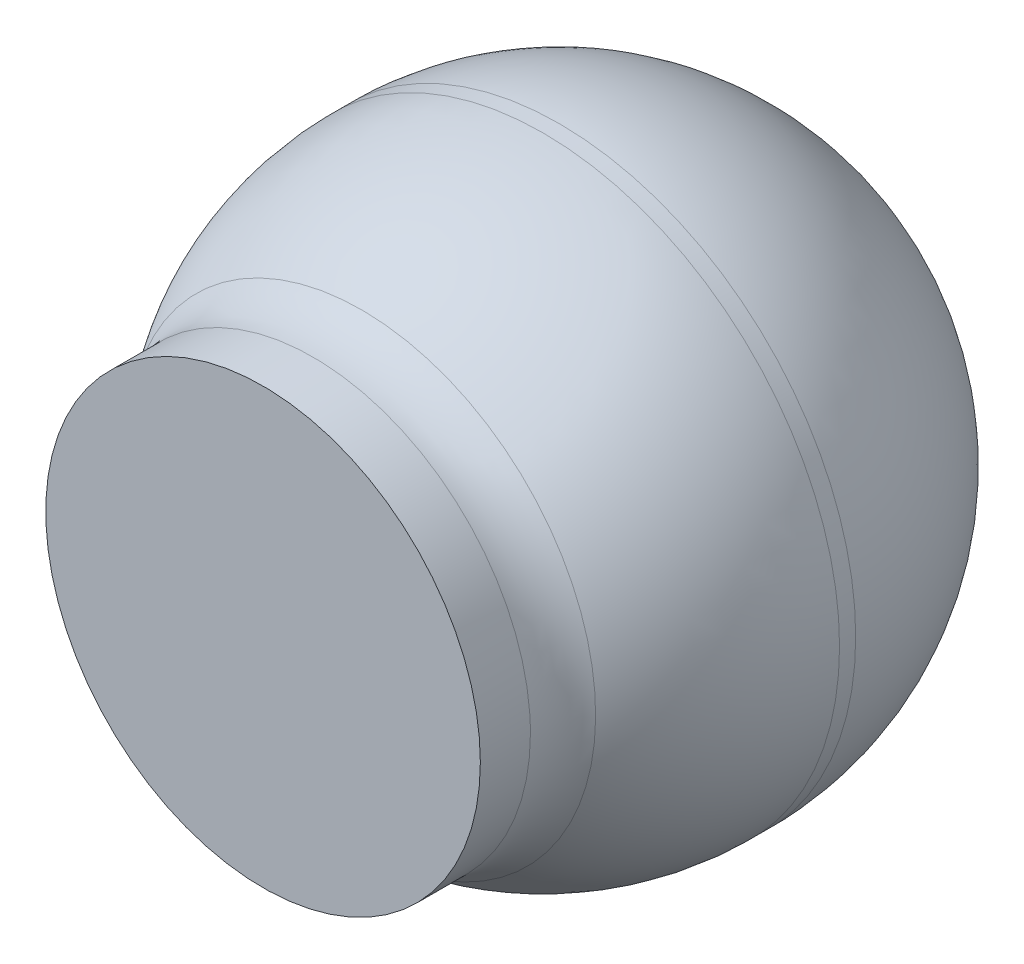
ISO-10303-21;
HEADER;
FILE_DESCRIPTION(('STEP AP214'),'2;1');
FILE_NAME('part.step','',(''),(''),'','','');
FILE_SCHEMA(('AUTOMOTIVE_DESIGN { 1 0 10303 214 1 1 1 1 }'));
ENDSEC;
DATA;
#1=APPLICATION_CONTEXT('core data for automotive mechanical design processes');
#2=APPLICATION_PROTOCOL_DEFINITION('international standard','automotive_design',2000,#1);
#3=PRODUCT_CONTEXT('',#1,'mechanical');
#4=PRODUCT('Part','Part','',(#3));
#5=PRODUCT_RELATED_PRODUCT_CATEGORY('part','',(#4));
#6=PRODUCT_DEFINITION_FORMATION('','',#4);
#7=PRODUCT_DEFINITION_CONTEXT('part definition',#1,'design');
#8=PRODUCT_DEFINITION('design','',#6,#7);
#9=PRODUCT_DEFINITION_SHAPE('','',#8);
#10=(LENGTH_UNIT() NAMED_UNIT(*) SI_UNIT(.MILLI.,.METRE.));
#11=(NAMED_UNIT(*) PLANE_ANGLE_UNIT() SI_UNIT($,.RADIAN.));
#12=(NAMED_UNIT(*) SI_UNIT($,.STERADIAN.) SOLID_ANGLE_UNIT());
#13=UNCERTAINTY_MEASURE_WITH_UNIT(LENGTH_MEASURE(1.E-05),#10,'distance_accuracy_value','');
#14=(GEOMETRIC_REPRESENTATION_CONTEXT(3) GLOBAL_UNCERTAINTY_ASSIGNED_CONTEXT((#13)) GLOBAL_UNIT_ASSIGNED_CONTEXT((#10,
#11,#12)) REPRESENTATION_CONTEXT('',''));
#15=CARTESIAN_POINT('',(0.,0.,0.));
#16=DIRECTION('',(0.,0.,1.));
#17=DIRECTION('',(1.,0.,0.));
#18=AXIS2_PLACEMENT_3D('',#15,#16,#17);
#19=CARTESIAN_POINT('',(-6.912919922269,-9.131349291452,10.006534503384));
#20=DIRECTION('',(0.,0.,-1.));
#21=DIRECTION('',(-1.,0.,0.));
#22=AXIS2_PLACEMENT_3D('',#19,#20,#21);
#23=PLANE('',#22);
#24=CARTESIAN_POINT('',(-6.912919922269,-9.131349291452,10.006534503384));
#25=DIRECTION('',(0.,0.,1.));
#26=DIRECTION('',(1.,0.,0.));
#27=AXIS2_PLACEMENT_3D('',#24,#25,#26);
#28=CIRCLE('',#27,0.275);
#29=CARTESIAN_POINT('',(-6.637919922269,-9.131349291452,10.006534503384));
#30=VERTEX_POINT('',#29);
#31=EDGE_CURVE('E20',#30,#30,#28,.F.);
#32=ORIENTED_EDGE('',*,*,#31,.F.);
#33=EDGE_LOOP('',(#32));
#34=FACE_BOUND('',#33,.T.);
#35=ADVANCED_FACE('F17',(#34),#23,.F.);
#36=CARTESIAN_POINT('',(-6.912919922269,-9.131349291452,9.906534503384));
#37=DIRECTION('',(0.,0.,1.));
#38=DIRECTION('',(1.,0.,0.));
#39=AXIS2_PLACEMENT_3D('',#36,#37,#38);
#40=CYLINDRICAL_SURFACE('',#39,0.275);
#41=CARTESIAN_POINT('',(-6.912919922269,-9.131349291452,9.943180457728));
#42=DIRECTION('',(0.,0.,-1.));
#43=DIRECTION('',(0.996700902337582,0.081162252799247,0.));
#44=AXIS2_PLACEMENT_3D('',#41,#42,#43);
#45=CIRCLE('',#44,0.275);
#46=CARTESIAN_POINT('',(-6.63882717412617,-9.10902967193221,9.943180457728));
#47=VERTEX_POINT('',#46);
#48=EDGE_CURVE('E65',#47,#47,#45,.F.);
#49=ORIENTED_EDGE('',*,*,#48,.T.);
#50=EDGE_LOOP('',(#49));
#51=FACE_BOUND('',#50,.T.);
#52=ORIENTED_EDGE('',*,*,#31,.T.);
#53=EDGE_LOOP('',(#52));
#54=FACE_BOUND('',#53,.T.);
#55=ADVANCED_FACE('F62',(#51,#54),#40,.T.);
#56=CARTESIAN_POINT('',(-6.912919922269,-9.131349291452,9.943180457728));
#57=DIRECTION('',(0.,0.,-1.));
#58=DIRECTION('',(0.996700902337583,0.0811622527992448,0.));
#59=AXIS2_PLACEMENT_3D('',#56,#57,#58);
#60=TOROIDAL_SURFACE('',#59,0.375,0.1);
#61=ORIENTED_EDGE('',*,*,#48,.F.);
#62=EDGE_LOOP('',(#61));
#63=FACE_BOUND('',#62,.T.);
#64=CARTESIAN_POINT('',(-6.912919922269,-9.131349291452,9.881744931236));
#65=DIRECTION('',(0.,0.,-1.));
#66=DIRECTION('',(-0.996700902337598,-0.0811622527990622,0.));
#67=AXIS2_PLACEMENT_3D('',#64,#65,#66);
#68=CIRCLE('',#67,0.296097046412665);
#69=CARTESIAN_POINT('',(-7.208040115608,-9.155381194786,9.881744931236));
#70=VERTEX_POINT('',#69);
#71=EDGE_CURVE('E39',#70,#70,#68,.T.);
#72=ORIENTED_EDGE('',*,*,#71,.F.);
#73=EDGE_LOOP('',(#72));
#74=FACE_BOUND('',#73,.T.);
#75=ADVANCED_FACE('F57',(#63,#74),#60,.F.);
#76=CARTESIAN_POINT('',(-7.286682760645,-9.161785136252,9.651976062157));
#77=CARTESIAN_POINT('',(-7.286682760645,-9.161785136252,9.701461392103));
#78=CARTESIAN_POINT('',(-7.278526217348,-9.161120941579,9.750947004335));
#79=CARTESIAN_POINT('',(-7.262207085349,-9.159792059952,9.798626332798));
#80=CARTESIAN_POINT('',(-7.238341390838,-9.157848654938,9.842699544317));
#81=CARTESIAN_POINT('',(-7.208040115608,-9.155381194786,9.881744931236));
#82=(BOUNDED_CURVE() B_SPLINE_CURVE(5,(#76,#77,#78,#79,#80,#81),.UNSPECIFIED.,.F.,
.F.) B_SPLINE_CURVE_WITH_KNOTS((6,6),(0.,0.661568582165),
.UNSPECIFIED.) CURVE() GEOMETRIC_REPRESENTATION_ITEM() RATIONAL_B_SPLINE_CURVE((1.,1.,1.,1.,1.,1.)) REPRESENTATION_ITEM(''));
#83=CARTESIAN_POINT('',(-6.912919922269,-9.131349291452,9.651976062157));
#84=DIRECTION('',(0.,0.,-1.));
#85=AXIS1_PLACEMENT('',#83,#84);
#86=SURFACE_OF_REVOLUTION('',#82,#85);
#87=CARTESIAN_POINT('',(-6.912919922269,-9.131349291452,9.651976062157));
#88=DIRECTION('',(0.,0.,1.));
#89=DIRECTION('',(1.,0.,0.));
#90=AXIS2_PLACEMENT_3D('',#87,#88,#89);
#91=CIRCLE('',#90,0.375);
#92=CARTESIAN_POINT('',(-6.537919922269,-9.131349291452,9.651976062157));
#93=VERTEX_POINT('',#92);
#94=EDGE_CURVE('E36',#93,#93,#91,.F.);
#95=ORIENTED_EDGE('',*,*,#94,.F.);
#96=EDGE_LOOP('',(#95));
#97=FACE_BOUND('',#96,.T.);
#98=ORIENTED_EDGE('',*,*,#71,.T.);
#99=EDGE_LOOP('',(#98));
#100=FACE_BOUND('',#99,.T.);
#101=ADVANCED_FACE('F53',(#97,#100),#86,.F.);
#102=CARTESIAN_POINT('',(-6.912919922269,-9.131349291452,9.256534503384));
#103=DIRECTION('',(0.,0.,1.));
#104=DIRECTION('',(1.,0.,0.));
#105=AXIS2_PLACEMENT_3D('',#102,#103,#104);
#106=CYLINDRICAL_SURFACE('',#105,0.375);
#107=CARTESIAN_POINT('',(-6.912919922269,-9.131349291452,9.631534503384));
#108=DIRECTION('',(0.,0.,-1.));
#109=DIRECTION('',(0.0811622527992357,-0.996700902337583,0.));
#110=AXIS2_PLACEMENT_3D('',#107,#108,#109);
#111=CIRCLE('',#110,0.375);
#112=CARTESIAN_POINT('',(-6.88248407746929,-9.50511212982859,9.631534503384));
#113=VERTEX_POINT('',#112);
#114=CARTESIAN_POINT('',(-6.94335576706871,-8.75758645307541,9.631534503384));
#115=VERTEX_POINT('',#114);
#116=EDGE_CURVE('E11',#113,#115,#111,.T.);
#117=ORIENTED_EDGE('',*,*,#116,.F.);
#118=CARTESIAN_POINT('',(-6.912919922269,-9.131349291452,9.631534503384));
#119=DIRECTION('',(0.,0.,1.));
#120=DIRECTION('',(0.0811622527992365,-0.996700902337583,0.));
#121=AXIS2_PLACEMENT_3D('',#118,#119,#120);
#122=CIRCLE('',#121,0.375);
#123=EDGE_CURVE('E25',#115,#113,#122,.F.);
#124=ORIENTED_EDGE('',*,*,#123,.F.);
#125=EDGE_LOOP('',(#117,#124));
#126=FACE_BOUND('',#125,.T.);
#127=ORIENTED_EDGE('',*,*,#94,.T.);
#128=EDGE_LOOP('',(#127));
#129=FACE_BOUND('',#128,.T.);
#130=ADVANCED_FACE('F34',(#126,#129),#106,.T.);
#131=CARTESIAN_POINT('',(-6.912919922269,-9.131349291452,9.631534503384));
#132=DIRECTION('',(0.0811622527992361,-0.996700902337583,0.));
#133=DIRECTION('',(-0.996700902337583,-0.0811622527992361,0.));
#134=AXIS2_PLACEMENT_3D('',#131,#132,#133);
#135=SPHERICAL_SURFACE('',#134,0.375);
#136=ORIENTED_EDGE('',*,*,#123,.T.);
#137=ORIENTED_EDGE('',*,*,#116,.T.);
#138=EDGE_LOOP('',(#136,#137));
#139=FACE_BOUND('',#138,.T.);
#140=ADVANCED_FACE('F32',(#139),#135,.T.);
#141=CLOSED_SHELL('',(#35,#55,#75,#101,#130,#140));
#142=MANIFOLD_SOLID_BREP('B1',#141);
#143=ADVANCED_BREP_SHAPE_REPRESENTATION('',(#18,#142),#14);
#144=SHAPE_DEFINITION_REPRESENTATION(#9,#143);
ENDSEC;
END-ISO-10303-21;
